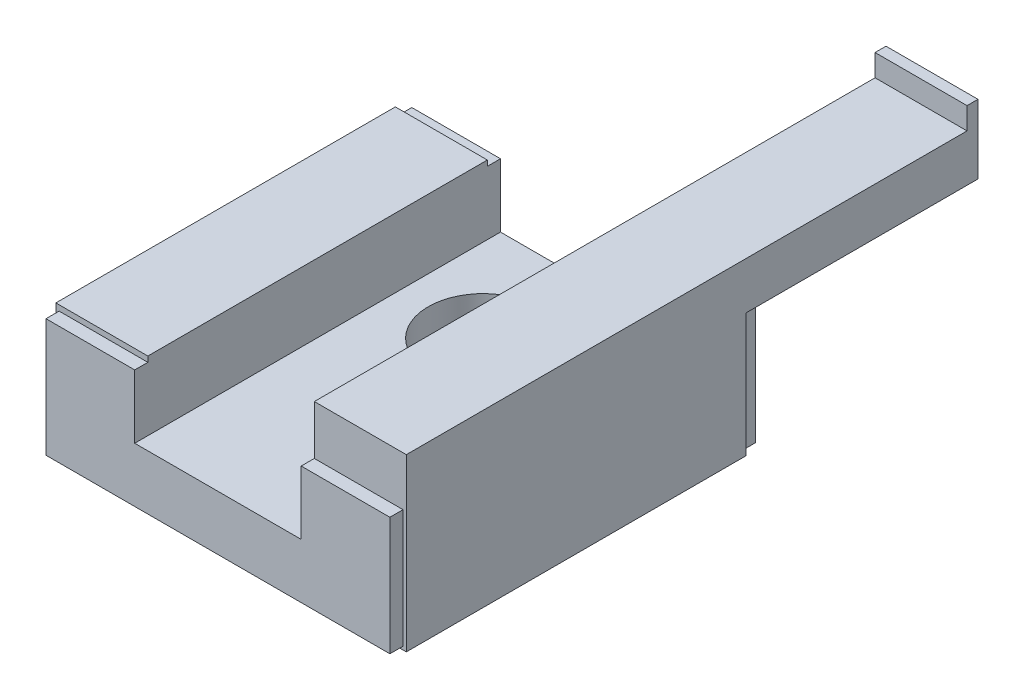
ISO-10303-21;
HEADER;
FILE_DESCRIPTION(('STEP AP214'),'2;1');
FILE_NAME('part.step','',(''),(''),'','','');
FILE_SCHEMA(('AUTOMOTIVE_DESIGN { 1 0 10303 214 1 1 1 1 }'));
ENDSEC;
DATA;
#1=APPLICATION_CONTEXT('core data for automotive mechanical design processes');
#2=APPLICATION_PROTOCOL_DEFINITION('international standard','automotive_design',2000,#1);
#3=PRODUCT_CONTEXT('',#1,'mechanical');
#4=PRODUCT('Part','Part','',(#3));
#5=PRODUCT_RELATED_PRODUCT_CATEGORY('part','',(#4));
#6=PRODUCT_DEFINITION_FORMATION('','',#4);
#7=PRODUCT_DEFINITION_CONTEXT('part definition',#1,'design');
#8=PRODUCT_DEFINITION('design','',#6,#7);
#9=PRODUCT_DEFINITION_SHAPE('','',#8);
#10=(LENGTH_UNIT() NAMED_UNIT(*) SI_UNIT(.MILLI.,.METRE.));
#11=(NAMED_UNIT(*) PLANE_ANGLE_UNIT() SI_UNIT($,.RADIAN.));
#12=(NAMED_UNIT(*) SI_UNIT($,.STERADIAN.) SOLID_ANGLE_UNIT());
#13=UNCERTAINTY_MEASURE_WITH_UNIT(LENGTH_MEASURE(1.E-05),#10,'distance_accuracy_value','');
#14=(GEOMETRIC_REPRESENTATION_CONTEXT(3) GLOBAL_UNCERTAINTY_ASSIGNED_CONTEXT((#13)) GLOBAL_UNIT_ASSIGNED_CONTEXT((#10,
#11,#12)) REPRESENTATION_CONTEXT('',''));
#15=CARTESIAN_POINT('',(0.,0.,0.));
#16=DIRECTION('',(0.,0.,1.));
#17=DIRECTION('',(1.,0.,0.));
#18=AXIS2_PLACEMENT_3D('',#15,#16,#17);
#19=CARTESIAN_POINT('',(16.,15.6,33.4));
#20=DIRECTION('',(0.,-1.,0.));
#21=DIRECTION('',(0.,0.,-1.));
#22=AXIS2_PLACEMENT_3D('',#19,#20,#21);
#23=PLANE('',#22);
#24=DIRECTION('',(1.,0.,0.));
#25=VECTOR('',#24,1.);
#26=CARTESIAN_POINT('',(7.6,15.6,-19.));
#27=LINE('',#26,#25);
#28=CARTESIAN_POINT('',(7.6,15.6,-19.));
#29=VERTEX_POINT('',#28);
#30=CARTESIAN_POINT('',(16.,15.6,-19.));
#31=VERTEX_POINT('',#30);
#32=EDGE_CURVE('E49',#29,#31,#27,.T.);
#33=ORIENTED_EDGE('',*,*,#32,.F.);
#34=DIRECTION('',(0.,0.,-1.));
#35=VECTOR('',#34,1.);
#36=CARTESIAN_POINT('',(7.6,15.6,33.4));
#37=LINE('',#36,#35);
#38=CARTESIAN_POINT('',(7.6,15.6,32.2));
#39=VERTEX_POINT('',#38);
#40=EDGE_CURVE('E220',#39,#29,#37,.T.);
#41=ORIENTED_EDGE('',*,*,#40,.F.);
#42=DIRECTION('',(-1.,0.,0.));
#43=VECTOR('',#42,1.);
#44=CARTESIAN_POINT('',(16.,15.6,32.2));
#45=LINE('',#44,#43);
#46=CARTESIAN_POINT('',(16.,15.6,32.2));
#47=VERTEX_POINT('',#46);
#48=EDGE_CURVE('E215',#47,#39,#45,.T.);
#49=ORIENTED_EDGE('',*,*,#48,.F.);
#50=DIRECTION('',(0.,0.,-1.));
#51=VECTOR('',#50,1.);
#52=CARTESIAN_POINT('',(16.,15.6,33.4));
#53=LINE('',#52,#51);
#54=EDGE_CURVE('E214',#47,#31,#53,.T.);
#55=ORIENTED_EDGE('',*,*,#54,.T.);
#56=EDGE_LOOP('',(#33,#41,#49,#55));
#57=FACE_BOUND('',#56,.T.);
#58=ADVANCED_FACE('F32',(#57),#23,.F.);
#59=CARTESIAN_POINT('',(-7.7,0.3,33.4));
#60=DIRECTION('',(0.,1.,0.));
#61=DIRECTION('',(0.,0.,1.));
#62=AXIS2_PLACEMENT_3D('',#59,#60,#61);
#63=PLANE('',#62);
#64=CARTESIAN_POINT('',(0.,0.3,24.7));
#65=DIRECTION('',(0.,1.,0.));
#66=DIRECTION('',(0.,0.,1.));
#67=AXIS2_PLACEMENT_3D('',#64,#65,#66);
#68=CIRCLE('',#67,1.5);
#69=CARTESIAN_POINT('',(0.,0.3,26.2));
#70=VERTEX_POINT('',#69);
#71=EDGE_CURVE('E259',#70,#70,#68,.F.);
#72=ORIENTED_EDGE('',*,*,#71,.F.);
#73=EDGE_LOOP('',(#72));
#74=FACE_BOUND('',#73,.T.);
#75=DIRECTION('',(1.,0.,0.));
#76=VECTOR('',#75,1.);
#77=CARTESIAN_POINT('',(-7.7,0.3,33.4));
#78=LINE('',#77,#76);
#79=CARTESIAN_POINT('',(-15.7,0.3,33.4));
#80=VERTEX_POINT('',#79);
#81=CARTESIAN_POINT('',(15.7,0.3,33.4));
#82=VERTEX_POINT('',#81);
#83=EDGE_CURVE('E425',#80,#82,#78,.T.);
#84=ORIENTED_EDGE('',*,*,#83,.F.);
#85=DIRECTION('',(0.,0.,1.));
#86=VECTOR('',#85,1.);
#87=CARTESIAN_POINT('',(-15.7,0.3,32.2));
#88=LINE('',#87,#86);
#89=CARTESIAN_POINT('',(-15.7,0.3,32.2));
#90=VERTEX_POINT('',#89);
#91=EDGE_CURVE('E362',#90,#80,#88,.T.);
#92=ORIENTED_EDGE('',*,*,#91,.F.);
#93=DIRECTION('',(-1.,0.,0.));
#94=VECTOR('',#93,1.);
#95=CARTESIAN_POINT('',(15.7,0.3,32.2));
#96=LINE('',#95,#94);
#97=CARTESIAN_POINT('',(-7.7,0.3,32.2));
#98=VERTEX_POINT('',#97);
#99=EDGE_CURVE('E333',#98,#90,#96,.T.);
#100=ORIENTED_EDGE('',*,*,#99,.F.);
#101=DIRECTION('',(0.,0.,-1.));
#102=VECTOR('',#101,1.);
#103=CARTESIAN_POINT('',(-7.7,0.3,33.4));
#104=LINE('',#103,#102);
#105=CARTESIAN_POINT('',(-7.7,0.3,1.2));
#106=VERTEX_POINT('',#105);
#107=EDGE_CURVE('E464',#98,#106,#104,.T.);
#108=ORIENTED_EDGE('',*,*,#107,.T.);
#109=DIRECTION('',(-1.,0.,0.));
#110=VECTOR('',#109,1.);
#111=CARTESIAN_POINT('',(15.7,0.3,1.2));
#112=LINE('',#111,#110);
#113=CARTESIAN_POINT('',(-15.7,0.3,1.2));
#114=VERTEX_POINT('',#113);
#115=EDGE_CURVE('E388',#106,#114,#112,.T.);
#116=ORIENTED_EDGE('',*,*,#115,.T.);
#117=DIRECTION('',(0.,0.,-1.));
#118=VECTOR('',#117,1.);
#119=CARTESIAN_POINT('',(-15.7,0.3,1.2));
#120=LINE('',#119,#118);
#121=CARTESIAN_POINT('',(-15.7,0.3,0.));
#122=VERTEX_POINT('',#121);
#123=EDGE_CURVE('E412',#114,#122,#120,.T.);
#124=ORIENTED_EDGE('',*,*,#123,.T.);
#125=DIRECTION('',(1.,0.,0.));
#126=VECTOR('',#125,1.);
#127=CARTESIAN_POINT('',(-7.7,0.3,0.));
#128=LINE('',#127,#126);
#129=CARTESIAN_POINT('',(15.7,0.3,0.));
#130=VERTEX_POINT('',#129);
#131=EDGE_CURVE('E424',#122,#130,#128,.T.);
#132=ORIENTED_EDGE('',*,*,#131,.T.);
#133=DIRECTION('',(0.,0.,-1.));
#134=VECTOR('',#133,1.);
#135=CARTESIAN_POINT('',(15.7,0.3,1.2));
#136=LINE('',#135,#134);
#137=CARTESIAN_POINT('',(15.7,0.3,1.2));
#138=VERTEX_POINT('',#137);
#139=EDGE_CURVE('E415',#138,#130,#136,.T.);
#140=ORIENTED_EDGE('',*,*,#139,.F.);
#141=CARTESIAN_POINT('',(7.7,0.3,1.2));
#142=VERTEX_POINT('',#141);
#143=EDGE_CURVE('E389',#138,#142,#112,.T.);
#144=ORIENTED_EDGE('',*,*,#143,.T.);
#145=DIRECTION('',(0.,0.,-1.));
#146=VECTOR('',#145,1.);
#147=CARTESIAN_POINT('',(7.7,0.3,33.4));
#148=LINE('',#147,#146);
#149=CARTESIAN_POINT('',(7.7,0.3,32.2));
#150=VERTEX_POINT('',#149);
#151=EDGE_CURVE('E466',#150,#142,#148,.T.);
#152=ORIENTED_EDGE('',*,*,#151,.F.);
#153=CARTESIAN_POINT('',(15.7,0.3,32.2));
#154=VERTEX_POINT('',#153);
#155=EDGE_CURVE('E334',#154,#150,#96,.T.);
#156=ORIENTED_EDGE('',*,*,#155,.F.);
#157=DIRECTION('',(0.,0.,1.));
#158=VECTOR('',#157,1.);
#159=CARTESIAN_POINT('',(15.7,0.3,32.2));
#160=LINE('',#159,#158);
#161=EDGE_CURVE('E365',#154,#82,#160,.T.);
#162=ORIENTED_EDGE('',*,*,#161,.T.);
#163=EDGE_LOOP('',(#84,#92,#100,#108,#116,#124,#132,#140,#144,#152,#156,#162));
#164=FACE_BOUND('',#163,.T.);
#165=CARTESIAN_POINT('',(0.,0.3,9.2));
#166=DIRECTION('',(0.,1.,0.));
#167=DIRECTION('',(0.,0.,1.));
#168=AXIS2_PLACEMENT_3D('',#165,#166,#167);
#169=CIRCLE('',#168,5.);
#170=CARTESIAN_POINT('',(0.,0.3,14.2));
#171=VERTEX_POINT('',#170);
#172=EDGE_CURVE('E253',#171,#171,#169,.F.);
#173=ORIENTED_EDGE('',*,*,#172,.F.);
#174=EDGE_LOOP('',(#173));
#175=FACE_BOUND('',#174,.T.);
#176=ADVANCED_FACE('F490',(#74,#164,#175),#63,.F.);
#177=CARTESIAN_POINT('',(7.6,5.3,33.4));
#178=DIRECTION('',(0.,-1.,0.));
#179=DIRECTION('',(0.,0.,-1.));
#180=AXIS2_PLACEMENT_3D('',#177,#178,#179);
#181=PLANE('',#180);
#182=DIRECTION('',(-1.,0.,0.));
#183=VECTOR('',#182,1.);
#184=CARTESIAN_POINT('',(7.6,5.3,0.));
#185=LINE('',#184,#183);
#186=CARTESIAN_POINT('',(7.6,5.3,0.));
#187=VERTEX_POINT('',#186);
#188=CARTESIAN_POINT('',(-7.6,5.3,0.));
#189=VERTEX_POINT('',#188);
#190=EDGE_CURVE('E439',#187,#189,#185,.T.);
#191=ORIENTED_EDGE('',*,*,#190,.T.);
#192=DIRECTION('',(0.,0.,-1.));
#193=VECTOR('',#192,1.);
#194=CARTESIAN_POINT('',(-7.6,5.3,33.4));
#195=LINE('',#194,#193);
#196=CARTESIAN_POINT('',(-7.6,5.3,33.4));
#197=VERTEX_POINT('',#196);
#198=EDGE_CURVE('E446',#197,#189,#195,.T.);
#199=ORIENTED_EDGE('',*,*,#198,.F.);
#200=DIRECTION('',(-1.,0.,0.));
#201=VECTOR('',#200,1.);
#202=CARTESIAN_POINT('',(7.6,5.3,33.4));
#203=LINE('',#202,#201);
#204=CARTESIAN_POINT('',(7.6,5.3,33.4));
#205=VERTEX_POINT('',#204);
#206=EDGE_CURVE('E430',#205,#197,#203,.T.);
#207=ORIENTED_EDGE('',*,*,#206,.F.);
#208=DIRECTION('',(0.,0.,-1.));
#209=VECTOR('',#208,1.);
#210=CARTESIAN_POINT('',(7.6,5.3,33.4));
#211=LINE('',#210,#209);
#212=EDGE_CURVE('E449',#205,#187,#211,.T.);
#213=ORIENTED_EDGE('',*,*,#212,.T.);
#214=EDGE_LOOP('',(#191,#199,#207,#213));
#215=FACE_BOUND('',#214,.T.);
#216=CARTESIAN_POINT('',(0.,5.3,9.2));
#217=DIRECTION('',(0.,-1.,0.));
#218=DIRECTION('',(0.,0.,-1.));
#219=AXIS2_PLACEMENT_3D('',#216,#217,#218);
#220=CIRCLE('',#219,5.);
#221=CARTESIAN_POINT('',(0.,5.3,4.2));
#222=VERTEX_POINT('',#221);
#223=EDGE_CURVE('E252',#222,#222,#220,.F.);
#224=ORIENTED_EDGE('',*,*,#223,.F.);
#225=EDGE_LOOP('',(#224));
#226=FACE_BOUND('',#225,.T.);
#227=ADVANCED_FACE('F520',(#215,#226),#181,.F.);
#228=CARTESIAN_POINT('',(-16.,0.,33.4));
#229=DIRECTION('',(0.,1.,0.));
#230=DIRECTION('',(-1.,0.,0.));
#231=AXIS2_PLACEMENT_3D('',#228,#229,#230);
#232=PLANE('',#231);
#233=CARTESIAN_POINT('',(-12.,0.,8.7));
#234=DIRECTION('',(0.,1.,0.));
#235=DIRECTION('',(0.,0.,1.));
#236=AXIS2_PLACEMENT_3D('',#233,#234,#235);
#237=CIRCLE('',#236,2.);
#238=CARTESIAN_POINT('',(-12.,0.,10.7));
#239=VERTEX_POINT('',#238);
#240=EDGE_CURVE('E278',#239,#239,#237,.T.);
#241=ORIENTED_EDGE('',*,*,#240,.T.);
#242=EDGE_LOOP('',(#241));
#243=FACE_BOUND('',#242,.T.);
#244=DIRECTION('',(1.,0.,0.));
#245=VECTOR('',#244,1.);
#246=CARTESIAN_POINT('',(-16.,0.,32.2));
#247=LINE('',#246,#245);
#248=CARTESIAN_POINT('',(-16.,0.,32.2));
#249=VERTEX_POINT('',#248);
#250=CARTESIAN_POINT('',(-7.99999999999999,0.,32.2));
#251=VERTEX_POINT('',#250);
#252=EDGE_CURVE('E319',#249,#251,#247,.T.);
#253=ORIENTED_EDGE('',*,*,#252,.F.);
#254=DIRECTION('',(0.,0.,-1.));
#255=VECTOR('',#254,1.);
#256=CARTESIAN_POINT('',(-16.,0.,33.4));
#257=LINE('',#256,#255);
#258=CARTESIAN_POINT('',(-16.,0.,1.2));
#259=VERTEX_POINT('',#258);
#260=EDGE_CURVE('E41',#249,#259,#257,.T.);
#261=ORIENTED_EDGE('',*,*,#260,.T.);
#262=DIRECTION('',(1.,0.,0.));
#263=VECTOR('',#262,1.);
#264=CARTESIAN_POINT('',(-16.,0.,1.2));
#265=LINE('',#264,#263);
#266=CARTESIAN_POINT('',(-8.,0.,1.2));
#267=VERTEX_POINT('',#266);
#268=EDGE_CURVE('E380',#259,#267,#265,.T.);
#269=ORIENTED_EDGE('',*,*,#268,.T.);
#270=DIRECTION('',(0.,0.,-1.));
#271=VECTOR('',#270,1.);
#272=CARTESIAN_POINT('',(-8.,0.,33.4));
#273=LINE('',#272,#271);
#274=EDGE_CURVE('E462',#251,#267,#273,.T.);
#275=ORIENTED_EDGE('',*,*,#274,.F.);
#276=EDGE_LOOP('',(#253,#261,#269,#275));
#277=FACE_BOUND('',#276,.T.);
#278=CARTESIAN_POINT('',(-12.,0.,24.7));
#279=DIRECTION('',(0.,1.,0.));
#280=DIRECTION('',(0.,0.,1.));
#281=AXIS2_PLACEMENT_3D('',#278,#279,#280);
#282=CIRCLE('',#281,2.);
#283=CARTESIAN_POINT('',(-12.,0.,26.7));
#284=VERTEX_POINT('',#283);
#285=EDGE_CURVE('E260',#284,#284,#282,.T.);
#286=ORIENTED_EDGE('',*,*,#285,.T.);
#287=EDGE_LOOP('',(#286));
#288=FACE_BOUND('',#287,.T.);
#289=ADVANCED_FACE('F531',(#243,#277,#288),#232,.F.);
#290=CARTESIAN_POINT('',(8.,0.,33.4));
#291=DIRECTION('',(0.,1.,0.));
#292=DIRECTION('',(-1.,0.,0.));
#293=AXIS2_PLACEMENT_3D('',#290,#291,#292);
#294=PLANE('',#293);
#295=CARTESIAN_POINT('',(12.,0.,8.7));
#296=DIRECTION('',(0.,1.,0.));
#297=DIRECTION('',(0.,0.,1.));
#298=AXIS2_PLACEMENT_3D('',#295,#296,#297);
#299=CIRCLE('',#298,2.);
#300=CARTESIAN_POINT('',(12.,0.,10.7));
#301=VERTEX_POINT('',#300);
#302=EDGE_CURVE('E287',#301,#301,#299,.T.);
#303=ORIENTED_EDGE('',*,*,#302,.T.);
#304=EDGE_LOOP('',(#303));
#305=FACE_BOUND('',#304,.T.);
#306=CARTESIAN_POINT('',(8.,0.,32.2));
#307=VERTEX_POINT('',#306);
#308=CARTESIAN_POINT('',(16.,0.,32.2));
#309=VERTEX_POINT('',#308);
#310=EDGE_CURVE('E317',#307,#309,#247,.T.);
#311=ORIENTED_EDGE('',*,*,#310,.F.);
#312=DIRECTION('',(0.,0.,-1.));
#313=VECTOR('',#312,1.);
#314=CARTESIAN_POINT('',(8.,0.,33.4));
#315=LINE('',#314,#313);
#316=CARTESIAN_POINT('',(8.,0.,1.2));
#317=VERTEX_POINT('',#316);
#318=EDGE_CURVE('E468',#307,#317,#315,.T.);
#319=ORIENTED_EDGE('',*,*,#318,.T.);
#320=CARTESIAN_POINT('',(16.,0.,1.2));
#321=VERTEX_POINT('',#320);
#322=EDGE_CURVE('E378',#317,#321,#265,.T.);
#323=ORIENTED_EDGE('',*,*,#322,.T.);
#324=DIRECTION('',(0.,0.,-1.));
#325=VECTOR('',#324,1.);
#326=CARTESIAN_POINT('',(16.,0.,33.4));
#327=LINE('',#326,#325);
#328=EDGE_CURVE('E219',#309,#321,#327,.T.);
#329=ORIENTED_EDGE('',*,*,#328,.F.);
#330=EDGE_LOOP('',(#311,#319,#323,#329));
#331=FACE_BOUND('',#330,.T.);
#332=CARTESIAN_POINT('',(12.,0.,24.7));
#333=DIRECTION('',(0.,1.,0.));
#334=DIRECTION('',(0.,0.,1.));
#335=AXIS2_PLACEMENT_3D('',#332,#333,#334);
#336=CIRCLE('',#335,2.);
#337=CARTESIAN_POINT('',(12.,0.,26.7));
#338=VERTEX_POINT('',#337);
#339=EDGE_CURVE('E269',#338,#338,#336,.T.);
#340=ORIENTED_EDGE('',*,*,#339,.T.);
#341=EDGE_LOOP('',(#340));
#342=FACE_BOUND('',#341,.T.);
#343=ADVANCED_FACE('F480',(#305,#331,#342),#294,.F.);
#344=CARTESIAN_POINT('',(-16.,11.6,33.4));
#345=DIRECTION('',(1.,0.,0.));
#346=DIRECTION('',(0.,0.,-1.));
#347=AXIS2_PLACEMENT_3D('',#344,#345,#346);
#348=PLANE('',#347);
#349=DIRECTION('',(0.,-1.,0.));
#350=VECTOR('',#349,1.);
#351=CARTESIAN_POINT('',(-16.,11.6,32.2));
#352=LINE('',#351,#350);
#353=CARTESIAN_POINT('',(-16.,11.6,32.2));
#354=VERTEX_POINT('',#353);
#355=EDGE_CURVE('E315',#354,#249,#352,.T.);
#356=ORIENTED_EDGE('',*,*,#355,.F.);
#357=DIRECTION('',(0.,0.,-1.));
#358=VECTOR('',#357,1.);
#359=CARTESIAN_POINT('',(-16.,11.6,33.4));
#360=LINE('',#359,#358);
#361=CARTESIAN_POINT('',(-16.,11.6,1.2));
#362=VERTEX_POINT('',#361);
#363=EDGE_CURVE('E435',#354,#362,#360,.T.);
#364=ORIENTED_EDGE('',*,*,#363,.T.);
#365=DIRECTION('',(0.,-1.,0.));
#366=VECTOR('',#365,1.);
#367=CARTESIAN_POINT('',(-16.,11.6,1.2));
#368=LINE('',#367,#366);
#369=EDGE_CURVE('E375',#362,#259,#368,.T.);
#370=ORIENTED_EDGE('',*,*,#369,.T.);
#371=ORIENTED_EDGE('',*,*,#260,.F.);
#372=EDGE_LOOP('',(#356,#364,#370,#371));
#373=FACE_BOUND('',#372,.T.);
#374=ADVANCED_FACE('F34',(#373),#348,.F.);
#375=CARTESIAN_POINT('',(-8.,0.,33.4));
#376=DIRECTION('',(-0.707106781186545,0.70710678118655,0.));
#377=DIRECTION('',(-0.70710678118655,-0.707106781186545,0.));
#378=AXIS2_PLACEMENT_3D('',#375,#376,#377);
#379=PLANE('',#378);
#380=DIRECTION('',(0.70710678118655,0.707106781186545,0.));
#381=VECTOR('',#380,1.);
#382=CARTESIAN_POINT('',(-8.,0.,32.2));
#383=LINE('',#382,#381);
#384=EDGE_CURVE('E372',#251,#98,#383,.T.);
#385=ORIENTED_EDGE('',*,*,#384,.F.);
#386=ORIENTED_EDGE('',*,*,#274,.T.);
#387=DIRECTION('',(0.70710678118655,0.707106781186545,0.));
#388=VECTOR('',#387,1.);
#389=CARTESIAN_POINT('',(-8.,0.,1.2));
#390=LINE('',#389,#388);
#391=EDGE_CURVE('E421',#267,#106,#390,.T.);
#392=ORIENTED_EDGE('',*,*,#391,.T.);
#393=ORIENTED_EDGE('',*,*,#107,.F.);
#394=EDGE_LOOP('',(#385,#386,#392,#393));
#395=FACE_BOUND('',#394,.T.);
#396=ADVANCED_FACE('F534',(#395),#379,.F.);
#397=CARTESIAN_POINT('',(7.7,0.3,33.4));
#398=DIRECTION('',(0.707106781186541,0.707106781186554,0.));
#399=DIRECTION('',(-0.707106781186554,0.707106781186541,0.));
#400=AXIS2_PLACEMENT_3D('',#397,#398,#399);
#401=PLANE('',#400);
#402=DIRECTION('',(0.707106781186554,-0.707106781186541,0.));
#403=VECTOR('',#402,1.);
#404=CARTESIAN_POINT('',(7.7,0.3,32.2));
#405=LINE('',#404,#403);
#406=EDGE_CURVE('E359',#150,#307,#405,.T.);
#407=ORIENTED_EDGE('',*,*,#406,.F.);
#408=ORIENTED_EDGE('',*,*,#151,.T.);
#409=DIRECTION('',(0.707106781186554,-0.707106781186541,0.));
#410=VECTOR('',#409,1.);
#411=CARTESIAN_POINT('',(7.7,0.3,1.2));
#412=LINE('',#411,#410);
#413=EDGE_CURVE('E418',#142,#317,#412,.T.);
#414=ORIENTED_EDGE('',*,*,#413,.T.);
#415=ORIENTED_EDGE('',*,*,#318,.F.);
#416=EDGE_LOOP('',(#407,#408,#414,#415));
#417=FACE_BOUND('',#416,.T.);
#418=ADVANCED_FACE('F485',(#417),#401,.F.);
#419=CARTESIAN_POINT('',(16.,0.,33.4));
#420=DIRECTION('',(-1.,0.,0.));
#421=DIRECTION('',(0.,0.,1.));
#422=AXIS2_PLACEMENT_3D('',#419,#420,#421);
#423=PLANE('',#422);
#424=DIRECTION('',(0.,1.,0.));
#425=VECTOR('',#424,1.);
#426=CARTESIAN_POINT('',(16.,0.,32.2));
#427=LINE('',#426,#425);
#428=EDGE_CURVE('E321',#309,#47,#427,.T.);
#429=ORIENTED_EDGE('',*,*,#428,.F.);
#430=ORIENTED_EDGE('',*,*,#328,.T.);
#431=DIRECTION('',(0.,1.,0.));
#432=VECTOR('',#431,1.);
#433=CARTESIAN_POINT('',(16.,0.,1.2));
#434=LINE('',#433,#432);
#435=CARTESIAN_POINT('',(16.,11.3,1.2));
#436=VERTEX_POINT('',#435);
#437=EDGE_CURVE('E383',#321,#436,#434,.T.);
#438=ORIENTED_EDGE('',*,*,#437,.T.);
#439=DIRECTION('',(0.,0.,1.));
#440=VECTOR('',#439,1.);
#441=CARTESIAN_POINT('',(16.,11.3,-20.));
#442=LINE('',#441,#440);
#443=CARTESIAN_POINT('',(16.,11.3,-20.));
#444=VERTEX_POINT('',#443);
#445=EDGE_CURVE('E307',#444,#436,#442,.T.);
#446=ORIENTED_EDGE('',*,*,#445,.F.);
#447=DIRECTION('',(0.,1.,0.));
#448=VECTOR('',#447,1.);
#449=CARTESIAN_POINT('',(16.,11.3,-20.));
#450=LINE('',#449,#448);
#451=CARTESIAN_POINT('',(16.,17.6,-20.));
#452=VERTEX_POINT('',#451);
#453=EDGE_CURVE('E303',#444,#452,#450,.T.);
#454=ORIENTED_EDGE('',*,*,#453,.T.);
#455=DIRECTION('',(0.,0.,-1.));
#456=VECTOR('',#455,1.);
#457=CARTESIAN_POINT('',(16.,17.6,-19.));
#458=LINE('',#457,#456);
#459=CARTESIAN_POINT('',(16.,17.6,-19.));
#460=VERTEX_POINT('',#459);
#461=EDGE_CURVE('E232',#460,#452,#458,.T.);
#462=ORIENTED_EDGE('',*,*,#461,.F.);
#463=DIRECTION('',(0.,1.,0.));
#464=VECTOR('',#463,1.);
#465=CARTESIAN_POINT('',(16.,15.6,-19.));
#466=LINE('',#465,#464);
#467=EDGE_CURVE('E225',#31,#460,#466,.T.);
#468=ORIENTED_EDGE('',*,*,#467,.F.);
#469=ORIENTED_EDGE('',*,*,#54,.F.);
#470=EDGE_LOOP('',(#429,#430,#438,#446,#454,#462,#468,#469));
#471=FACE_BOUND('',#470,.T.);
#472=ADVANCED_FACE('F230',(#471),#423,.F.);
#473=CARTESIAN_POINT('',(-7.6,11.6,33.4));
#474=DIRECTION('',(0.,-1.,0.));
#475=DIRECTION('',(0.,0.,-1.));
#476=AXIS2_PLACEMENT_3D('',#473,#474,#475);
#477=PLANE('',#476);
#478=DIRECTION('',(-1.,0.,0.));
#479=VECTOR('',#478,1.);
#480=CARTESIAN_POINT('',(-7.6,11.6,32.2));
#481=LINE('',#480,#479);
#482=CARTESIAN_POINT('',(-7.6,11.6,32.2));
#483=VERTEX_POINT('',#482);
#484=EDGE_CURVE('E344',#483,#354,#481,.T.);
#485=ORIENTED_EDGE('',*,*,#484,.F.);
#486=DIRECTION('',(0.,0.,-1.));
#487=VECTOR('',#486,1.);
#488=CARTESIAN_POINT('',(-7.6,11.6,33.4));
#489=LINE('',#488,#487);
#490=CARTESIAN_POINT('',(-7.6,11.6,1.2));
#491=VERTEX_POINT('',#490);
#492=EDGE_CURVE('E444',#483,#491,#489,.T.);
#493=ORIENTED_EDGE('',*,*,#492,.T.);
#494=DIRECTION('',(-1.,0.,0.));
#495=VECTOR('',#494,1.);
#496=CARTESIAN_POINT('',(-7.6,11.6,1.2));
#497=LINE('',#496,#495);
#498=EDGE_CURVE('E399',#491,#362,#497,.T.);
#499=ORIENTED_EDGE('',*,*,#498,.T.);
#500=ORIENTED_EDGE('',*,*,#363,.F.);
#501=EDGE_LOOP('',(#485,#493,#499,#500));
#502=FACE_BOUND('',#501,.T.);
#503=ADVANCED_FACE('F528',(#502),#477,.F.);
#504=CARTESIAN_POINT('',(7.6,15.6,33.4));
#505=DIRECTION('',(1.,0.,0.));
#506=DIRECTION('',(0.,0.,-1.));
#507=AXIS2_PLACEMENT_3D('',#504,#505,#506);
#508=PLANE('',#507);
#509=DIRECTION('',(0.,0.,1.));
#510=VECTOR('',#509,1.);
#511=CARTESIAN_POINT('',(7.6,11.3,-20.));
#512=LINE('',#511,#510);
#513=CARTESIAN_POINT('',(7.6,11.3,-20.));
#514=VERTEX_POINT('',#513);
#515=CARTESIAN_POINT('',(7.6,11.3,0.));
#516=VERTEX_POINT('',#515);
#517=EDGE_CURVE('E305',#514,#516,#512,.T.);
#518=ORIENTED_EDGE('',*,*,#517,.T.);
#519=DIRECTION('',(0.,-1.,0.));
#520=VECTOR('',#519,1.);
#521=CARTESIAN_POINT('',(7.6,15.6,0.));
#522=LINE('',#521,#520);
#523=EDGE_CURVE('E57',#516,#187,#522,.T.);
#524=ORIENTED_EDGE('',*,*,#523,.T.);
#525=ORIENTED_EDGE('',*,*,#212,.F.);
#526=DIRECTION('',(0.,-1.,0.));
#527=VECTOR('',#526,1.);
#528=CARTESIAN_POINT('',(7.6,15.6,33.4));
#529=LINE('',#528,#527);
#530=CARTESIAN_POINT('',(7.6,11.1,33.4));
#531=VERTEX_POINT('',#530);
#532=EDGE_CURVE('E427',#531,#205,#529,.T.);
#533=ORIENTED_EDGE('',*,*,#532,.F.);
#534=DIRECTION('',(0.,0.,1.));
#535=VECTOR('',#534,1.);
#536=CARTESIAN_POINT('',(7.6,11.1,32.2));
#537=LINE('',#536,#535);
#538=CARTESIAN_POINT('',(7.6,11.1,32.2));
#539=VERTEX_POINT('',#538);
#540=EDGE_CURVE('E346',#539,#531,#537,.T.);
#541=ORIENTED_EDGE('',*,*,#540,.F.);
#542=DIRECTION('',(0.,-1.,0.));
#543=VECTOR('',#542,1.);
#544=CARTESIAN_POINT('',(7.6,15.6,32.2));
#545=LINE('',#544,#543);
#546=EDGE_CURVE('E324',#39,#539,#545,.T.);
#547=ORIENTED_EDGE('',*,*,#546,.F.);
#548=ORIENTED_EDGE('',*,*,#40,.T.);
#549=DIRECTION('',(0.,-1.,0.));
#550=VECTOR('',#549,1.);
#551=CARTESIAN_POINT('',(7.6,17.6,-19.));
#552=LINE('',#551,#550);
#553=CARTESIAN_POINT('',(7.6,17.6,-19.));
#554=VERTEX_POINT('',#553);
#555=EDGE_CURVE('E228',#554,#29,#552,.T.);
#556=ORIENTED_EDGE('',*,*,#555,.F.);
#557=DIRECTION('',(0.,0.,-1.));
#558=VECTOR('',#557,1.);
#559=CARTESIAN_POINT('',(7.6,17.6,-19.));
#560=LINE('',#559,#558);
#561=CARTESIAN_POINT('',(7.6,17.6,-20.));
#562=VERTEX_POINT('',#561);
#563=EDGE_CURVE('E236',#554,#562,#560,.T.);
#564=ORIENTED_EDGE('',*,*,#563,.T.);
#565=DIRECTION('',(0.,-1.,0.));
#566=VECTOR('',#565,1.);
#567=CARTESIAN_POINT('',(7.6,15.6,-20.));
#568=LINE('',#567,#566);
#569=EDGE_CURVE('E297',#562,#514,#568,.T.);
#570=ORIENTED_EDGE('',*,*,#569,.T.);
#571=EDGE_LOOP('',(#518,#524,#525,#533,#541,#547,#548,#556,#564,#570));
#572=FACE_BOUND('',#571,.T.);
#573=ADVANCED_FACE('F502',(#572),#508,.F.);
#574=CARTESIAN_POINT('',(-7.6,5.3,33.4));
#575=DIRECTION('',(-1.,0.,0.));
#576=DIRECTION('',(0.,0.,1.));
#577=AXIS2_PLACEMENT_3D('',#574,#575,#576);
#578=PLANE('',#577);
#579=DIRECTION('',(0.,1.,0.));
#580=VECTOR('',#579,1.);
#581=CARTESIAN_POINT('',(-7.6,11.1,32.2));
#582=LINE('',#581,#580);
#583=CARTESIAN_POINT('',(-7.6,11.1,32.2));
#584=VERTEX_POINT('',#583);
#585=EDGE_CURVE('E342',#584,#483,#582,.T.);
#586=ORIENTED_EDGE('',*,*,#585,.F.);
#587=DIRECTION('',(0.,0.,1.));
#588=VECTOR('',#587,1.);
#589=CARTESIAN_POINT('',(-7.6,11.1,32.2));
#590=LINE('',#589,#588);
#591=CARTESIAN_POINT('',(-7.6,11.1,33.4));
#592=VERTEX_POINT('',#591);
#593=EDGE_CURVE('E356',#584,#592,#590,.T.);
#594=ORIENTED_EDGE('',*,*,#593,.T.);
#595=DIRECTION('',(0.,1.,0.));
#596=VECTOR('',#595,1.);
#597=CARTESIAN_POINT('',(-7.6,5.3,33.4));
#598=LINE('',#597,#596);
#599=EDGE_CURVE('E432',#197,#592,#598,.T.);
#600=ORIENTED_EDGE('',*,*,#599,.F.);
#601=ORIENTED_EDGE('',*,*,#198,.T.);
#602=DIRECTION('',(0.,1.,0.));
#603=VECTOR('',#602,1.);
#604=CARTESIAN_POINT('',(-7.6,5.3,0.));
#605=LINE('',#604,#603);
#606=CARTESIAN_POINT('',(-7.6,11.1,0.));
#607=VERTEX_POINT('',#606);
#608=EDGE_CURVE('E428',#189,#607,#605,.T.);
#609=ORIENTED_EDGE('',*,*,#608,.T.);
#610=DIRECTION('',(0.,0.,-1.));
#611=VECTOR('',#610,1.);
#612=CARTESIAN_POINT('',(-7.6,11.1,1.2));
#613=LINE('',#612,#611);
#614=CARTESIAN_POINT('',(-7.6,11.1,1.2));
#615=VERTEX_POINT('',#614);
#616=EDGE_CURVE('E402',#615,#607,#613,.T.);
#617=ORIENTED_EDGE('',*,*,#616,.F.);
#618=DIRECTION('',(0.,1.,0.));
#619=VECTOR('',#618,1.);
#620=CARTESIAN_POINT('',(-7.6,11.1,1.2));
#621=LINE('',#620,#619);
#622=EDGE_CURVE('E396',#615,#491,#621,.T.);
#623=ORIENTED_EDGE('',*,*,#622,.T.);
#624=ORIENTED_EDGE('',*,*,#492,.F.);
#625=EDGE_LOOP('',(#586,#594,#600,#601,#609,#617,#623,#624));
#626=FACE_BOUND('',#625,.T.);
#627=ADVANCED_FACE('F654',(#626),#578,.F.);
#628=CARTESIAN_POINT('',(0.,0.,0.));
#629=DIRECTION('',(0.,0.,1.));
#630=DIRECTION('',(1.,0.,0.));
#631=AXIS2_PLACEMENT_3D('',#628,#629,#630);
#632=PLANE('',#631);
#633=ORIENTED_EDGE('',*,*,#523,.F.);
#634=DIRECTION('',(1.,0.,0.));
#635=VECTOR('',#634,1.);
#636=CARTESIAN_POINT('',(0.,11.3,0.));
#637=LINE('',#636,#635);
#638=CARTESIAN_POINT('',(15.7,11.3,0.));
#639=VERTEX_POINT('',#638);
#640=EDGE_CURVE('E310',#516,#639,#637,.T.);
#641=ORIENTED_EDGE('',*,*,#640,.T.);
#642=DIRECTION('',(0.,-1.,0.));
#643=VECTOR('',#642,1.);
#644=CARTESIAN_POINT('',(15.7,11.6,0.));
#645=LINE('',#644,#643);
#646=EDGE_CURVE('E374',#639,#130,#645,.T.);
#647=ORIENTED_EDGE('',*,*,#646,.T.);
#648=ORIENTED_EDGE('',*,*,#131,.F.);
#649=DIRECTION('',(0.,1.,0.));
#650=VECTOR('',#649,1.);
#651=CARTESIAN_POINT('',(-15.7,0.3,0.));
#652=LINE('',#651,#650);
#653=CARTESIAN_POINT('',(-15.7,11.1,0.));
#654=VERTEX_POINT('',#653);
#655=EDGE_CURVE('E404',#122,#654,#652,.T.);
#656=ORIENTED_EDGE('',*,*,#655,.T.);
#657=DIRECTION('',(1.,0.,0.));
#658=VECTOR('',#657,1.);
#659=CARTESIAN_POINT('',(-15.7,11.1,0.));
#660=LINE('',#659,#658);
#661=EDGE_CURVE('E379',#654,#607,#660,.T.);
#662=ORIENTED_EDGE('',*,*,#661,.T.);
#663=ORIENTED_EDGE('',*,*,#608,.F.);
#664=ORIENTED_EDGE('',*,*,#190,.F.);
#665=EDGE_LOOP('',(#633,#641,#647,#648,#656,#662,#663,#664));
#666=FACE_BOUND('',#665,.T.);
#667=ADVANCED_FACE('F650',(#666),#632,.F.);
#668=CARTESIAN_POINT('',(0.,0.,33.4));
#669=DIRECTION('',(0.,0.,1.));
#670=DIRECTION('',(1.,0.,0.));
#671=AXIS2_PLACEMENT_3D('',#668,#669,#670);
#672=PLANE('',#671);
#673=DIRECTION('',(1.,0.,0.));
#674=VECTOR('',#673,1.);
#675=CARTESIAN_POINT('',(-15.7,11.1,33.4));
#676=LINE('',#675,#674);
#677=CARTESIAN_POINT('',(-15.7,11.1,33.4));
#678=VERTEX_POINT('',#677);
#679=EDGE_CURVE('E318',#678,#592,#676,.T.);
#680=ORIENTED_EDGE('',*,*,#679,.F.);
#681=DIRECTION('',(0.,1.,0.));
#682=VECTOR('',#681,1.);
#683=CARTESIAN_POINT('',(-15.7,0.3,33.4));
#684=LINE('',#683,#682);
#685=EDGE_CURVE('E352',#80,#678,#684,.T.);
#686=ORIENTED_EDGE('',*,*,#685,.F.);
#687=ORIENTED_EDGE('',*,*,#83,.T.);
#688=DIRECTION('',(0.,-1.,0.));
#689=VECTOR('',#688,1.);
#690=CARTESIAN_POINT('',(15.7,11.1,33.4));
#691=LINE('',#690,#689);
#692=CARTESIAN_POINT('',(15.7,11.1,33.4));
#693=VERTEX_POINT('',#692);
#694=EDGE_CURVE('E349',#693,#82,#691,.T.);
#695=ORIENTED_EDGE('',*,*,#694,.F.);
#696=DIRECTION('',(1.,0.,0.));
#697=VECTOR('',#696,1.);
#698=CARTESIAN_POINT('',(7.6,11.1,33.4));
#699=LINE('',#698,#697);
#700=EDGE_CURVE('E314',#531,#693,#699,.T.);
#701=ORIENTED_EDGE('',*,*,#700,.F.);
#702=ORIENTED_EDGE('',*,*,#532,.T.);
#703=ORIENTED_EDGE('',*,*,#206,.T.);
#704=ORIENTED_EDGE('',*,*,#599,.T.);
#705=EDGE_LOOP('',(#680,#686,#687,#695,#701,#702,#703,#704));
#706=FACE_BOUND('',#705,.T.);
#707=ADVANCED_FACE('F641',(#706),#672,.T.);
#708=CARTESIAN_POINT('',(-15.7,11.1,1.2));
#709=DIRECTION('',(0.,1.,0.));
#710=DIRECTION('',(0.,0.,1.));
#711=AXIS2_PLACEMENT_3D('',#708,#709,#710);
#712=PLANE('',#711);
#713=ORIENTED_EDGE('',*,*,#661,.F.);
#714=DIRECTION('',(0.,0.,-1.));
#715=VECTOR('',#714,1.);
#716=CARTESIAN_POINT('',(-15.7,11.1,1.2));
#717=LINE('',#716,#715);
#718=CARTESIAN_POINT('',(-15.7,11.1,1.2));
#719=VERTEX_POINT('',#718);
#720=EDGE_CURVE('E410',#719,#654,#717,.T.);
#721=ORIENTED_EDGE('',*,*,#720,.F.);
#722=DIRECTION('',(1.,0.,0.));
#723=VECTOR('',#722,1.);
#724=CARTESIAN_POINT('',(-15.7,11.1,1.2));
#725=LINE('',#724,#723);
#726=EDGE_CURVE('E394',#719,#615,#725,.T.);
#727=ORIENTED_EDGE('',*,*,#726,.T.);
#728=ORIENTED_EDGE('',*,*,#616,.T.);
#729=EDGE_LOOP('',(#713,#721,#727,#728));
#730=FACE_BOUND('',#729,.T.);
#731=ADVANCED_FACE('F638',(#730),#712,.T.);
#732=CARTESIAN_POINT('',(-15.7,0.3,1.2));
#733=DIRECTION('',(-1.,0.,0.));
#734=DIRECTION('',(0.,0.,1.));
#735=AXIS2_PLACEMENT_3D('',#732,#733,#734);
#736=PLANE('',#735);
#737=ORIENTED_EDGE('',*,*,#655,.F.);
#738=ORIENTED_EDGE('',*,*,#123,.F.);
#739=DIRECTION('',(0.,1.,0.));
#740=VECTOR('',#739,1.);
#741=CARTESIAN_POINT('',(-15.7,0.3,1.2));
#742=LINE('',#741,#740);
#743=EDGE_CURVE('E392',#114,#719,#742,.T.);
#744=ORIENTED_EDGE('',*,*,#743,.T.);
#745=ORIENTED_EDGE('',*,*,#720,.T.);
#746=EDGE_LOOP('',(#737,#738,#744,#745));
#747=FACE_BOUND('',#746,.T.);
#748=ADVANCED_FACE('F636',(#747),#736,.T.);
#749=CARTESIAN_POINT('',(0.,0.,1.2));
#750=DIRECTION('',(0.,0.,1.));
#751=DIRECTION('',(1.,0.,0.));
#752=AXIS2_PLACEMENT_3D('',#749,#750,#751);
#753=PLANE('',#752);
#754=ORIENTED_EDGE('',*,*,#268,.F.);
#755=ORIENTED_EDGE('',*,*,#369,.F.);
#756=ORIENTED_EDGE('',*,*,#498,.F.);
#757=ORIENTED_EDGE('',*,*,#622,.F.);
#758=ORIENTED_EDGE('',*,*,#726,.F.);
#759=ORIENTED_EDGE('',*,*,#743,.F.);
#760=ORIENTED_EDGE('',*,*,#115,.F.);
#761=ORIENTED_EDGE('',*,*,#391,.F.);
#762=EDGE_LOOP('',(#754,#755,#756,#757,#758,#759,#760,#761));
#763=FACE_BOUND('',#762,.T.);
#764=ADVANCED_FACE('F633',(#763),#753,.F.);
#765=DIRECTION('',(0.,-1.,0.));
#766=VECTOR('',#765,1.);
#767=CARTESIAN_POINT('',(15.7,11.6,1.2));
#768=LINE('',#767,#766);
#769=CARTESIAN_POINT('',(15.7,11.3,1.2));
#770=VERTEX_POINT('',#769);
#771=EDGE_CURVE('E386',#770,#138,#768,.T.);
#772=ORIENTED_EDGE('',*,*,#771,.F.);
#773=DIRECTION('',(1.,0.,0.));
#774=VECTOR('',#773,1.);
#775=CARTESIAN_POINT('',(7.6,11.3,1.2));
#776=LINE('',#775,#774);
#777=EDGE_CURVE('E296',#770,#436,#776,.T.);
#778=ORIENTED_EDGE('',*,*,#777,.T.);
#779=ORIENTED_EDGE('',*,*,#437,.F.);
#780=ORIENTED_EDGE('',*,*,#322,.F.);
#781=ORIENTED_EDGE('',*,*,#413,.F.);
#782=ORIENTED_EDGE('',*,*,#143,.F.);
#783=EDGE_LOOP('',(#772,#778,#779,#780,#781,#782));
#784=FACE_BOUND('',#783,.T.);
#785=ADVANCED_FACE('F477',(#784),#753,.F.);
#786=CARTESIAN_POINT('',(15.7,11.6,1.2));
#787=DIRECTION('',(1.,0.,0.));
#788=DIRECTION('',(0.,0.,-1.));
#789=AXIS2_PLACEMENT_3D('',#786,#787,#788);
#790=PLANE('',#789);
#791=DIRECTION('',(0.,0.,-1.));
#792=VECTOR('',#791,1.);
#793=CARTESIAN_POINT('',(15.7,11.3,1.2));
#794=LINE('',#793,#792);
#795=EDGE_CURVE('E11',#770,#639,#794,.T.);
#796=ORIENTED_EDGE('',*,*,#795,.F.);
#797=ORIENTED_EDGE('',*,*,#771,.T.);
#798=ORIENTED_EDGE('',*,*,#139,.T.);
#799=ORIENTED_EDGE('',*,*,#646,.F.);
#800=EDGE_LOOP('',(#796,#797,#798,#799));
#801=FACE_BOUND('',#800,.T.);
#802=ADVANCED_FACE('F494',(#801),#790,.T.);
#803=CARTESIAN_POINT('',(7.6,11.1,32.2));
#804=DIRECTION('',(0.,-1.,0.));
#805=DIRECTION('',(0.,0.,-1.));
#806=AXIS2_PLACEMENT_3D('',#803,#804,#805);
#807=PLANE('',#806);
#808=ORIENTED_EDGE('',*,*,#700,.T.);
#809=DIRECTION('',(0.,0.,1.));
#810=VECTOR('',#809,1.);
#811=CARTESIAN_POINT('',(15.7,11.1,32.2));
#812=LINE('',#811,#810);
#813=CARTESIAN_POINT('',(15.7,11.1,32.2));
#814=VERTEX_POINT('',#813);
#815=EDGE_CURVE('E368',#814,#693,#812,.T.);
#816=ORIENTED_EDGE('',*,*,#815,.F.);
#817=DIRECTION('',(1.,0.,0.));
#818=VECTOR('',#817,1.);
#819=CARTESIAN_POINT('',(7.6,11.1,32.2));
#820=LINE('',#819,#818);
#821=EDGE_CURVE('E327',#539,#814,#820,.T.);
#822=ORIENTED_EDGE('',*,*,#821,.F.);
#823=ORIENTED_EDGE('',*,*,#540,.T.);
#824=EDGE_LOOP('',(#808,#816,#822,#823));
#825=FACE_BOUND('',#824,.T.);
#826=ADVANCED_FACE('F628',(#825),#807,.F.);
#827=CARTESIAN_POINT('',(15.7,11.1,32.2));
#828=DIRECTION('',(-1.,0.,0.));
#829=DIRECTION('',(0.,0.,1.));
#830=AXIS2_PLACEMENT_3D('',#827,#828,#829);
#831=PLANE('',#830);
#832=ORIENTED_EDGE('',*,*,#694,.T.);
#833=ORIENTED_EDGE('',*,*,#161,.F.);
#834=DIRECTION('',(0.,-1.,0.));
#835=VECTOR('',#834,1.);
#836=CARTESIAN_POINT('',(15.7,11.1,32.2));
#837=LINE('',#836,#835);
#838=EDGE_CURVE('E330',#814,#154,#837,.T.);
#839=ORIENTED_EDGE('',*,*,#838,.F.);
#840=ORIENTED_EDGE('',*,*,#815,.T.);
#841=EDGE_LOOP('',(#832,#833,#839,#840));
#842=FACE_BOUND('',#841,.T.);
#843=ADVANCED_FACE('F625',(#842),#831,.F.);
#844=CARTESIAN_POINT('',(0.,0.,32.2));
#845=DIRECTION('',(0.,0.,1.));
#846=DIRECTION('',(1.,0.,0.));
#847=AXIS2_PLACEMENT_3D('',#844,#845,#846);
#848=PLANE('',#847);
#849=ORIENTED_EDGE('',*,*,#406,.T.);
#850=ORIENTED_EDGE('',*,*,#310,.T.);
#851=ORIENTED_EDGE('',*,*,#428,.T.);
#852=ORIENTED_EDGE('',*,*,#48,.T.);
#853=ORIENTED_EDGE('',*,*,#546,.T.);
#854=ORIENTED_EDGE('',*,*,#821,.T.);
#855=ORIENTED_EDGE('',*,*,#838,.T.);
#856=ORIENTED_EDGE('',*,*,#155,.T.);
#857=EDGE_LOOP('',(#849,#850,#851,#852,#853,#854,#855,#856));
#858=FACE_BOUND('',#857,.T.);
#859=ADVANCED_FACE('F617',(#858),#848,.T.);
#860=ORIENTED_EDGE('',*,*,#384,.T.);
#861=ORIENTED_EDGE('',*,*,#99,.T.);
#862=DIRECTION('',(0.,1.,0.));
#863=VECTOR('',#862,1.);
#864=CARTESIAN_POINT('',(-15.7,0.3,32.2));
#865=LINE('',#864,#863);
#866=CARTESIAN_POINT('',(-15.7,11.1,32.2));
#867=VERTEX_POINT('',#866);
#868=EDGE_CURVE('E336',#90,#867,#865,.T.);
#869=ORIENTED_EDGE('',*,*,#868,.T.);
#870=DIRECTION('',(1.,0.,0.));
#871=VECTOR('',#870,1.);
#872=CARTESIAN_POINT('',(-15.7,11.1,32.2));
#873=LINE('',#872,#871);
#874=EDGE_CURVE('E339',#867,#584,#873,.T.);
#875=ORIENTED_EDGE('',*,*,#874,.T.);
#876=ORIENTED_EDGE('',*,*,#585,.T.);
#877=ORIENTED_EDGE('',*,*,#484,.T.);
#878=ORIENTED_EDGE('',*,*,#355,.T.);
#879=ORIENTED_EDGE('',*,*,#252,.T.);
#880=EDGE_LOOP('',(#860,#861,#869,#875,#876,#877,#878,#879));
#881=FACE_BOUND('',#880,.T.);
#882=ADVANCED_FACE('F613',(#881),#848,.T.);
#883=CARTESIAN_POINT('',(-15.7,11.1,32.2));
#884=DIRECTION('',(0.,-1.,0.));
#885=DIRECTION('',(0.,0.,-1.));
#886=AXIS2_PLACEMENT_3D('',#883,#884,#885);
#887=PLANE('',#886);
#888=ORIENTED_EDGE('',*,*,#679,.T.);
#889=ORIENTED_EDGE('',*,*,#593,.F.);
#890=ORIENTED_EDGE('',*,*,#874,.F.);
#891=DIRECTION('',(0.,0.,1.));
#892=VECTOR('',#891,1.);
#893=CARTESIAN_POINT('',(-15.7,11.1,32.2));
#894=LINE('',#893,#892);
#895=EDGE_CURVE('E360',#867,#678,#894,.T.);
#896=ORIENTED_EDGE('',*,*,#895,.T.);
#897=EDGE_LOOP('',(#888,#889,#890,#896));
#898=FACE_BOUND('',#897,.T.);
#899=ADVANCED_FACE('F616',(#898),#887,.F.);
#900=CARTESIAN_POINT('',(-15.7,0.3,32.2));
#901=DIRECTION('',(1.,0.,0.));
#902=DIRECTION('',(0.,0.,-1.));
#903=AXIS2_PLACEMENT_3D('',#900,#901,#902);
#904=PLANE('',#903);
#905=ORIENTED_EDGE('',*,*,#685,.T.);
#906=ORIENTED_EDGE('',*,*,#895,.F.);
#907=ORIENTED_EDGE('',*,*,#868,.F.);
#908=ORIENTED_EDGE('',*,*,#91,.T.);
#909=EDGE_LOOP('',(#905,#906,#907,#908));
#910=FACE_BOUND('',#909,.T.);
#911=ADVANCED_FACE('F612',(#910),#904,.F.);
#912=CARTESIAN_POINT('',(7.6,11.3,-20.));
#913=DIRECTION('',(0.,-1.,0.));
#914=DIRECTION('',(0.,0.,-1.));
#915=AXIS2_PLACEMENT_3D('',#912,#913,#914);
#916=PLANE('',#915);
#917=ORIENTED_EDGE('',*,*,#640,.F.);
#918=ORIENTED_EDGE('',*,*,#517,.F.);
#919=DIRECTION('',(1.,0.,0.));
#920=VECTOR('',#919,1.);
#921=CARTESIAN_POINT('',(7.6,11.3,-20.));
#922=LINE('',#921,#920);
#923=EDGE_CURVE('E300',#514,#444,#922,.T.);
#924=ORIENTED_EDGE('',*,*,#923,.T.);
#925=ORIENTED_EDGE('',*,*,#445,.T.);
#926=ORIENTED_EDGE('',*,*,#777,.F.);
#927=ORIENTED_EDGE('',*,*,#795,.T.);
#928=EDGE_LOOP('',(#917,#918,#924,#925,#926,#927));
#929=FACE_BOUND('',#928,.T.);
#930=ADVANCED_FACE('F496',(#929),#916,.T.);
#931=CARTESIAN_POINT('',(0.,0.,-20.));
#932=DIRECTION('',(0.,0.,1.));
#933=DIRECTION('',(1.,0.,0.));
#934=AXIS2_PLACEMENT_3D('',#931,#932,#933);
#935=PLANE('',#934);
#936=ORIENTED_EDGE('',*,*,#569,.F.);
#937=DIRECTION('',(-1.,0.,0.));
#938=VECTOR('',#937,1.);
#939=CARTESIAN_POINT('',(16.,17.6,-20.));
#940=LINE('',#939,#938);
#941=EDGE_CURVE('E242',#452,#562,#940,.T.);
#942=ORIENTED_EDGE('',*,*,#941,.F.);
#943=ORIENTED_EDGE('',*,*,#453,.F.);
#944=ORIENTED_EDGE('',*,*,#923,.F.);
#945=EDGE_LOOP('',(#936,#942,#943,#944));
#946=FACE_BOUND('',#945,.T.);
#947=ADVANCED_FACE('F500',(#946),#935,.F.);
#948=CARTESIAN_POINT('',(12.,4.,8.7));
#949=DIRECTION('',(0.,-1.,0.));
#950=DIRECTION('',(0.,0.,-1.));
#951=AXIS2_PLACEMENT_3D('',#948,#949,#950);
#952=PLANE('',#951);
#953=CARTESIAN_POINT('',(12.,4.,8.7));
#954=DIRECTION('',(0.,1.,0.));
#955=DIRECTION('',(0.,0.,1.));
#956=AXIS2_PLACEMENT_3D('',#953,#954,#955);
#957=CIRCLE('',#956,1.621);
#958=CARTESIAN_POINT('',(12.,4.,10.321));
#959=VERTEX_POINT('',#958);
#960=EDGE_CURVE('E293',#959,#959,#957,.T.);
#961=ORIENTED_EDGE('',*,*,#960,.F.);
#962=EDGE_LOOP('',(#961));
#963=FACE_BOUND('',#962,.T.);
#964=ADVANCED_FACE('F603',(#963),#952,.T.);
#965=CARTESIAN_POINT('',(12.,0.,8.7));
#966=DIRECTION('',(0.,1.,0.));
#967=DIRECTION('',(0.,0.,1.));
#968=AXIS2_PLACEMENT_3D('',#965,#966,#967);
#969=CYLINDRICAL_SURFACE('',#968,1.621);
#970=ORIENTED_EDGE('',*,*,#960,.T.);
#971=EDGE_LOOP('',(#970));
#972=FACE_BOUND('',#971,.T.);
#973=CARTESIAN_POINT('',(12.,0.379,8.7));
#974=DIRECTION('',(0.,1.,0.));
#975=DIRECTION('',(0.,0.,1.));
#976=AXIS2_PLACEMENT_3D('',#973,#974,#975);
#977=CIRCLE('',#976,1.621);
#978=CARTESIAN_POINT('',(12.,0.379,10.321));
#979=VERTEX_POINT('',#978);
#980=EDGE_CURVE('E290',#979,#979,#977,.T.);
#981=ORIENTED_EDGE('',*,*,#980,.F.);
#982=EDGE_LOOP('',(#981));
#983=FACE_BOUND('',#982,.T.);
#984=ADVANCED_FACE('F599',(#972,#983),#969,.F.);
#985=CARTESIAN_POINT('',(12.,0.,8.7));
#986=DIRECTION('',(0.,-1.,0.));
#987=DIRECTION('',(0.,0.,-1.));
#988=AXIS2_PLACEMENT_3D('',#985,#986,#987);
#989=CONICAL_SURFACE('',#988,2.,0.78539816339745);
#990=ORIENTED_EDGE('',*,*,#980,.T.);
#991=EDGE_LOOP('',(#990));
#992=FACE_BOUND('',#991,.T.);
#993=ORIENTED_EDGE('',*,*,#302,.F.);
#994=EDGE_LOOP('',(#993));
#995=FACE_BOUND('',#994,.T.);
#996=ADVANCED_FACE('F595',(#992,#995),#989,.F.);
#997=CARTESIAN_POINT('',(-12.,4.,8.7));
#998=DIRECTION('',(0.,-1.,0.));
#999=DIRECTION('',(0.,0.,-1.));
#1000=AXIS2_PLACEMENT_3D('',#997,#998,#999);
#1001=PLANE('',#1000);
#1002=CARTESIAN_POINT('',(-12.,4.,8.7));
#1003=DIRECTION('',(0.,1.,0.));
#1004=DIRECTION('',(0.,0.,1.));
#1005=AXIS2_PLACEMENT_3D('',#1002,#1003,#1004);
#1006=CIRCLE('',#1005,1.621);
#1007=CARTESIAN_POINT('',(-12.,4.,10.321));
#1008=VERTEX_POINT('',#1007);
#1009=EDGE_CURVE('E284',#1008,#1008,#1006,.T.);
#1010=ORIENTED_EDGE('',*,*,#1009,.F.);
#1011=EDGE_LOOP('',(#1010));
#1012=FACE_BOUND('',#1011,.T.);
#1013=ADVANCED_FACE('F591',(#1012),#1001,.T.);
#1014=CARTESIAN_POINT('',(-12.,0.,8.7));
#1015=DIRECTION('',(0.,1.,0.));
#1016=DIRECTION('',(0.,0.,1.));
#1017=AXIS2_PLACEMENT_3D('',#1014,#1015,#1016);
#1018=CYLINDRICAL_SURFACE('',#1017,1.621);
#1019=ORIENTED_EDGE('',*,*,#1009,.T.);
#1020=EDGE_LOOP('',(#1019));
#1021=FACE_BOUND('',#1020,.T.);
#1022=CARTESIAN_POINT('',(-12.,0.379,8.7));
#1023=DIRECTION('',(0.,1.,0.));
#1024=DIRECTION('',(0.,0.,1.));
#1025=AXIS2_PLACEMENT_3D('',#1022,#1023,#1024);
#1026=CIRCLE('',#1025,1.621);
#1027=CARTESIAN_POINT('',(-12.,0.379,10.321));
#1028=VERTEX_POINT('',#1027);
#1029=EDGE_CURVE('E281',#1028,#1028,#1026,.T.);
#1030=ORIENTED_EDGE('',*,*,#1029,.F.);
#1031=EDGE_LOOP('',(#1030));
#1032=FACE_BOUND('',#1031,.T.);
#1033=ADVANCED_FACE('F587',(#1021,#1032),#1018,.F.);
#1034=CARTESIAN_POINT('',(-12.,0.,8.7));
#1035=DIRECTION('',(0.,-1.,0.));
#1036=DIRECTION('',(0.,0.,-1.));
#1037=AXIS2_PLACEMENT_3D('',#1034,#1035,#1036);
#1038=CONICAL_SURFACE('',#1037,2.,0.78539816339745);
#1039=ORIENTED_EDGE('',*,*,#1029,.T.);
#1040=EDGE_LOOP('',(#1039));
#1041=FACE_BOUND('',#1040,.T.);
#1042=ORIENTED_EDGE('',*,*,#240,.F.);
#1043=EDGE_LOOP('',(#1042));
#1044=FACE_BOUND('',#1043,.T.);
#1045=ADVANCED_FACE('F583',(#1041,#1044),#1038,.F.);
#1046=CARTESIAN_POINT('',(12.,4.,24.7));
#1047=DIRECTION('',(0.,-1.,0.));
#1048=DIRECTION('',(0.,0.,-1.));
#1049=AXIS2_PLACEMENT_3D('',#1046,#1047,#1048);
#1050=PLANE('',#1049);
#1051=CARTESIAN_POINT('',(12.,4.,24.7));
#1052=DIRECTION('',(0.,1.,0.));
#1053=DIRECTION('',(0.,0.,1.));
#1054=AXIS2_PLACEMENT_3D('',#1051,#1052,#1053);
#1055=CIRCLE('',#1054,1.621);
#1056=CARTESIAN_POINT('',(12.,4.,26.321));
#1057=VERTEX_POINT('',#1056);
#1058=EDGE_CURVE('E275',#1057,#1057,#1055,.T.);
#1059=ORIENTED_EDGE('',*,*,#1058,.F.);
#1060=EDGE_LOOP('',(#1059));
#1061=FACE_BOUND('',#1060,.T.);
#1062=ADVANCED_FACE('F579',(#1061),#1050,.T.);
#1063=CARTESIAN_POINT('',(12.,0.,24.7));
#1064=DIRECTION('',(0.,1.,0.));
#1065=DIRECTION('',(0.,0.,1.));
#1066=AXIS2_PLACEMENT_3D('',#1063,#1064,#1065);
#1067=CYLINDRICAL_SURFACE('',#1066,1.621);
#1068=ORIENTED_EDGE('',*,*,#1058,.T.);
#1069=EDGE_LOOP('',(#1068));
#1070=FACE_BOUND('',#1069,.T.);
#1071=CARTESIAN_POINT('',(12.,0.379,24.7));
#1072=DIRECTION('',(0.,1.,0.));
#1073=DIRECTION('',(0.,0.,1.));
#1074=AXIS2_PLACEMENT_3D('',#1071,#1072,#1073);
#1075=CIRCLE('',#1074,1.621);
#1076=CARTESIAN_POINT('',(12.,0.379,26.321));
#1077=VERTEX_POINT('',#1076);
#1078=EDGE_CURVE('E272',#1077,#1077,#1075,.T.);
#1079=ORIENTED_EDGE('',*,*,#1078,.F.);
#1080=EDGE_LOOP('',(#1079));
#1081=FACE_BOUND('',#1080,.T.);
#1082=ADVANCED_FACE('F575',(#1070,#1081),#1067,.F.);
#1083=CARTESIAN_POINT('',(12.,0.,24.7));
#1084=DIRECTION('',(0.,-1.,0.));
#1085=DIRECTION('',(0.,0.,-1.));
#1086=AXIS2_PLACEMENT_3D('',#1083,#1084,#1085);
#1087=CONICAL_SURFACE('',#1086,2.,0.78539816339745);
#1088=ORIENTED_EDGE('',*,*,#1078,.T.);
#1089=EDGE_LOOP('',(#1088));
#1090=FACE_BOUND('',#1089,.T.);
#1091=ORIENTED_EDGE('',*,*,#339,.F.);
#1092=EDGE_LOOP('',(#1091));
#1093=FACE_BOUND('',#1092,.T.);
#1094=ADVANCED_FACE('F571',(#1090,#1093),#1087,.F.);
#1095=CARTESIAN_POINT('',(-12.,4.,24.7));
#1096=DIRECTION('',(0.,-1.,0.));
#1097=DIRECTION('',(0.,0.,-1.));
#1098=AXIS2_PLACEMENT_3D('',#1095,#1096,#1097);
#1099=PLANE('',#1098);
#1100=CARTESIAN_POINT('',(-12.,4.,24.7));
#1101=DIRECTION('',(0.,1.,0.));
#1102=DIRECTION('',(0.,0.,1.));
#1103=AXIS2_PLACEMENT_3D('',#1100,#1101,#1102);
#1104=CIRCLE('',#1103,1.621);
#1105=CARTESIAN_POINT('',(-12.,4.,26.321));
#1106=VERTEX_POINT('',#1105);
#1107=EDGE_CURVE('E266',#1106,#1106,#1104,.T.);
#1108=ORIENTED_EDGE('',*,*,#1107,.F.);
#1109=EDGE_LOOP('',(#1108));
#1110=FACE_BOUND('',#1109,.T.);
#1111=ADVANCED_FACE('F564',(#1110),#1099,.T.);
#1112=CARTESIAN_POINT('',(-12.,0.,24.7));
#1113=DIRECTION('',(0.,1.,0.));
#1114=DIRECTION('',(0.,0.,1.));
#1115=AXIS2_PLACEMENT_3D('',#1112,#1113,#1114);
#1116=CYLINDRICAL_SURFACE('',#1115,1.621);
#1117=ORIENTED_EDGE('',*,*,#1107,.T.);
#1118=EDGE_LOOP('',(#1117));
#1119=FACE_BOUND('',#1118,.T.);
#1120=CARTESIAN_POINT('',(-12.,0.379,24.7));
#1121=DIRECTION('',(0.,1.,0.));
#1122=DIRECTION('',(0.,0.,1.));
#1123=AXIS2_PLACEMENT_3D('',#1120,#1121,#1122);
#1124=CIRCLE('',#1123,1.621);
#1125=CARTESIAN_POINT('',(-12.,0.379,26.321));
#1126=VERTEX_POINT('',#1125);
#1127=EDGE_CURVE('E263',#1126,#1126,#1124,.T.);
#1128=ORIENTED_EDGE('',*,*,#1127,.F.);
#1129=EDGE_LOOP('',(#1128));
#1130=FACE_BOUND('',#1129,.T.);
#1131=ADVANCED_FACE('F555',(#1119,#1130),#1116,.F.);
#1132=CARTESIAN_POINT('',(-12.,0.,24.7));
#1133=DIRECTION('',(0.,-1.,0.));
#1134=DIRECTION('',(0.,0.,-1.));
#1135=AXIS2_PLACEMENT_3D('',#1132,#1133,#1134);
#1136=CONICAL_SURFACE('',#1135,2.,0.78539816339745);
#1137=ORIENTED_EDGE('',*,*,#1127,.T.);
#1138=EDGE_LOOP('',(#1137));
#1139=FACE_BOUND('',#1138,.T.);
#1140=ORIENTED_EDGE('',*,*,#285,.F.);
#1141=EDGE_LOOP('',(#1140));
#1142=FACE_BOUND('',#1141,.T.);
#1143=ADVANCED_FACE('F552',(#1139,#1142),#1136,.F.);
#1144=CARTESIAN_POINT('',(0.,3.3,24.7));
#1145=DIRECTION('',(0.,-1.,0.));
#1146=DIRECTION('',(0.,0.,-1.));
#1147=AXIS2_PLACEMENT_3D('',#1144,#1145,#1146);
#1148=CYLINDRICAL_SURFACE('',#1147,1.5);
#1149=CARTESIAN_POINT('',(0.,3.3,24.7));
#1150=DIRECTION('',(0.,1.,0.));
#1151=DIRECTION('',(0.,0.,1.));
#1152=AXIS2_PLACEMENT_3D('',#1149,#1150,#1151);
#1153=CIRCLE('',#1152,1.5);
#1154=CARTESIAN_POINT('',(0.,3.3,26.2));
#1155=VERTEX_POINT('',#1154);
#1156=EDGE_CURVE('E256',#1155,#1155,#1153,.T.);
#1157=ORIENTED_EDGE('',*,*,#1156,.T.);
#1158=EDGE_LOOP('',(#1157));
#1159=FACE_BOUND('',#1158,.T.);
#1160=ORIENTED_EDGE('',*,*,#71,.T.);
#1161=EDGE_LOOP('',(#1160));
#1162=FACE_BOUND('',#1161,.T.);
#1163=ADVANCED_FACE('F554',(#1159,#1162),#1148,.F.);
#1164=CARTESIAN_POINT('',(0.,3.3,24.7));
#1165=DIRECTION('',(0.,1.,0.));
#1166=DIRECTION('',(0.,0.,1.));
#1167=AXIS2_PLACEMENT_3D('',#1164,#1165,#1166);
#1168=PLANE('',#1167);
#1169=ORIENTED_EDGE('',*,*,#1156,.F.);
#1170=EDGE_LOOP('',(#1169));
#1171=FACE_BOUND('',#1170,.T.);
#1172=ADVANCED_FACE('F512',(#1171),#1168,.F.);
#1173=CARTESIAN_POINT('',(0.,5.5,9.2));
#1174=DIRECTION('',(0.,-1.,0.));
#1175=DIRECTION('',(0.,0.,-1.));
#1176=AXIS2_PLACEMENT_3D('',#1173,#1174,#1175);
#1177=CYLINDRICAL_SURFACE('',#1176,5.);
#1178=ORIENTED_EDGE('',*,*,#223,.T.);
#1179=EDGE_LOOP('',(#1178));
#1180=FACE_BOUND('',#1179,.T.);
#1181=ORIENTED_EDGE('',*,*,#172,.T.);
#1182=EDGE_LOOP('',(#1181));
#1183=FACE_BOUND('',#1182,.T.);
#1184=ADVANCED_FACE('F505',(#1180,#1183),#1177,.F.);
#1185=CARTESIAN_POINT('',(16.,17.6,-19.));
#1186=DIRECTION('',(0.,-1.,0.));
#1187=DIRECTION('',(0.,0.,-1.));
#1188=AXIS2_PLACEMENT_3D('',#1185,#1186,#1187);
#1189=PLANE('',#1188);
#1190=ORIENTED_EDGE('',*,*,#941,.T.);
#1191=ORIENTED_EDGE('',*,*,#563,.F.);
#1192=DIRECTION('',(-1.,0.,0.));
#1193=VECTOR('',#1192,1.);
#1194=CARTESIAN_POINT('',(16.,17.6,-19.));
#1195=LINE('',#1194,#1193);
#1196=EDGE_CURVE('E234',#460,#554,#1195,.T.);
#1197=ORIENTED_EDGE('',*,*,#1196,.F.);
#1198=ORIENTED_EDGE('',*,*,#461,.T.);
#1199=EDGE_LOOP('',(#1190,#1191,#1197,#1198));
#1200=FACE_BOUND('',#1199,.T.);
#1201=ADVANCED_FACE('F503',(#1200),#1189,.F.);
#1202=CARTESIAN_POINT('',(0.,0.,-19.));
#1203=DIRECTION('',(0.,0.,1.));
#1204=DIRECTION('',(1.,0.,0.));
#1205=AXIS2_PLACEMENT_3D('',#1202,#1203,#1204);
#1206=PLANE('',#1205);
#1207=ORIENTED_EDGE('',*,*,#555,.T.);
#1208=ORIENTED_EDGE('',*,*,#32,.T.);
#1209=ORIENTED_EDGE('',*,*,#467,.T.);
#1210=ORIENTED_EDGE('',*,*,#1196,.T.);
#1211=EDGE_LOOP('',(#1207,#1208,#1209,#1210));
#1212=FACE_BOUND('',#1211,.T.);
#1213=ADVANCED_FACE('F224',(#1212),#1206,.T.);
#1214=CLOSED_SHELL('',(#58,#176,#227,#289,#343,#374,#396,#418,#472,#503,#573,#627,#667,#707,
#731,#748,#764,#785,#802,#826,#843,#859,#882,#899,#911,#930,#947,#964,#984,#996,#1013,#1033,
#1045,#1062,#1082,#1094,#1111,#1131,#1143,#1163,#1172,#1184,#1201,#1213));
#1215=MANIFOLD_SOLID_BREP('B2',#1214);
#1216=ADVANCED_BREP_SHAPE_REPRESENTATION('',(#18,#1215),#14);
#1217=SHAPE_DEFINITION_REPRESENTATION(#9,#1216);
ENDSEC;
END-ISO-10303-21;
